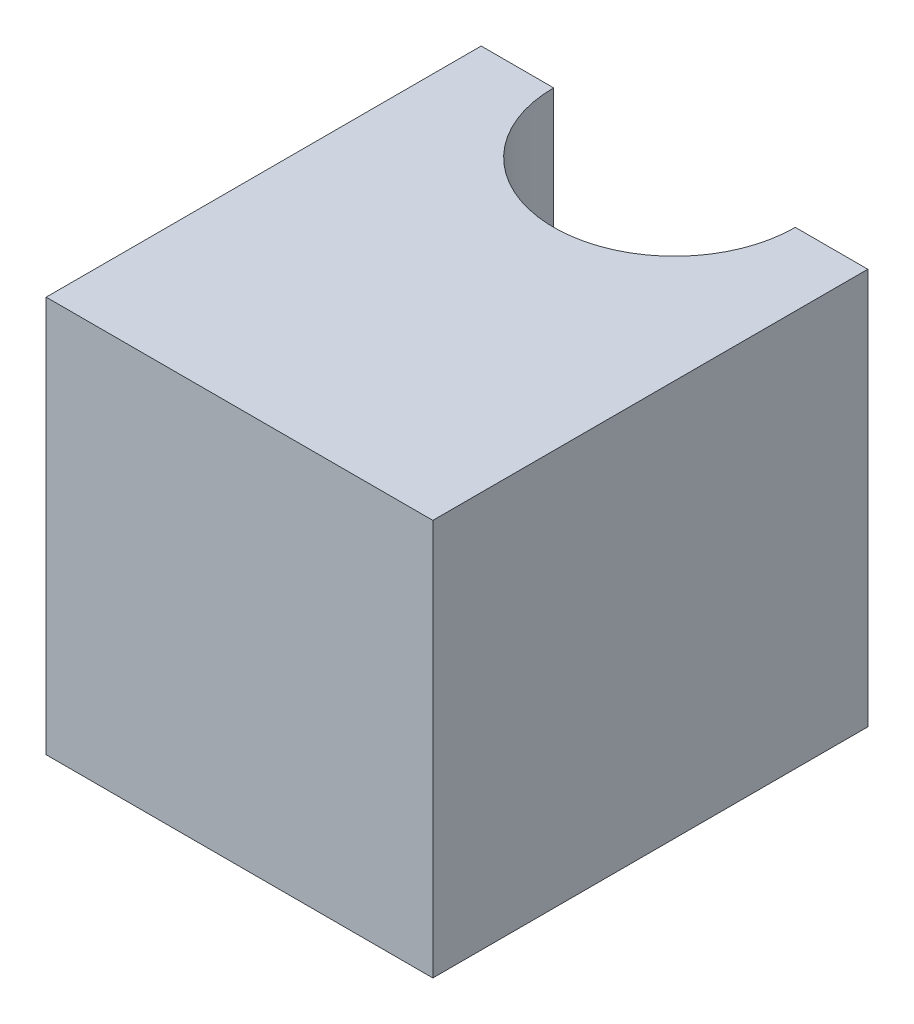
ISO-10303-21;
HEADER;
FILE_DESCRIPTION(('STEP AP214'),'2;1');
FILE_NAME('part.step','',(''),(''),'','','');
FILE_SCHEMA(('AUTOMOTIVE_DESIGN { 1 0 10303 214 1 1 1 1 }'));
ENDSEC;
DATA;
#1=APPLICATION_CONTEXT('core data for automotive mechanical design processes');
#2=APPLICATION_PROTOCOL_DEFINITION('international standard','automotive_design',2000,#1);
#3=PRODUCT_CONTEXT('',#1,'mechanical');
#4=PRODUCT('Part','Part','',(#3));
#5=PRODUCT_RELATED_PRODUCT_CATEGORY('part','',(#4));
#6=PRODUCT_DEFINITION_FORMATION('','',#4);
#7=PRODUCT_DEFINITION_CONTEXT('part definition',#1,'design');
#8=PRODUCT_DEFINITION('design','',#6,#7);
#9=PRODUCT_DEFINITION_SHAPE('','',#8);
#10=(LENGTH_UNIT() NAMED_UNIT(*) SI_UNIT(.MILLI.,.METRE.));
#11=(NAMED_UNIT(*) PLANE_ANGLE_UNIT() SI_UNIT($,.RADIAN.));
#12=(NAMED_UNIT(*) SI_UNIT($,.STERADIAN.) SOLID_ANGLE_UNIT());
#13=UNCERTAINTY_MEASURE_WITH_UNIT(LENGTH_MEASURE(1.E-05),#10,'distance_accuracy_value','');
#14=(GEOMETRIC_REPRESENTATION_CONTEXT(3) GLOBAL_UNCERTAINTY_ASSIGNED_CONTEXT((#13)) GLOBAL_UNIT_ASSIGNED_CONTEXT((#10,
#11,#12)) REPRESENTATION_CONTEXT('',''));
#15=CARTESIAN_POINT('',(0.,0.,0.));
#16=DIRECTION('',(0.,0.,1.));
#17=DIRECTION('',(1.,0.,0.));
#18=AXIS2_PLACEMENT_3D('',#15,#16,#17);
#19=CARTESIAN_POINT('',(3.,0.,-5.2));
#20=DIRECTION('',(1.,0.,0.));
#21=DIRECTION('',(0.,0.,-1.));
#22=AXIS2_PLACEMENT_3D('',#19,#20,#21);
#23=PLANE('',#22);
#24=DIRECTION('',(0.,0.,1.));
#25=VECTOR('',#24,1.);
#26=CARTESIAN_POINT('',(3.,0.82,-5.65));
#27=LINE('',#26,#25);
#28=CARTESIAN_POINT('',(3.,0.82,-5.2));
#29=VERTEX_POINT('',#28);
#30=CARTESIAN_POINT('',(3.,0.82,-6.1));
#31=VERTEX_POINT('',#30);
#32=EDGE_CURVE('E108',#29,#31,#27,.F.);
#33=ORIENTED_EDGE('',*,*,#32,.F.);
#34=DIRECTION('',(0.,1.,0.));
#35=VECTOR('',#34,1.);
#36=CARTESIAN_POINT('',(3.,0.,-5.2));
#37=LINE('',#36,#35);
#38=CARTESIAN_POINT('',(3.,0.,-5.2));
#39=VERTEX_POINT('',#38);
#40=EDGE_CURVE('E92',#39,#29,#37,.T.);
#41=ORIENTED_EDGE('',*,*,#40,.F.);
#42=DIRECTION('',(0.,0.,1.));
#43=VECTOR('',#42,1.);
#44=CARTESIAN_POINT('',(3.,0.,-5.65));
#45=LINE('',#44,#43);
#46=CARTESIAN_POINT('',(3.,0.,-6.1));
#47=VERTEX_POINT('',#46);
#48=EDGE_CURVE('E76',#39,#47,#45,.F.);
#49=ORIENTED_EDGE('',*,*,#48,.T.);
#50=DIRECTION('',(0.,1.,0.));
#51=VECTOR('',#50,1.);
#52=CARTESIAN_POINT('',(3.,0.,-6.1));
#53=LINE('',#52,#51);
#54=EDGE_CURVE('E73',#31,#47,#53,.F.);
#55=ORIENTED_EDGE('',*,*,#54,.F.);
#56=EDGE_LOOP('',(#33,#41,#49,#55));
#57=FACE_BOUND('',#56,.T.);
#58=ADVANCED_FACE('F17',(#57),#23,.T.);
#59=CARTESIAN_POINT('',(3.,0.,-6.1));
#60=DIRECTION('',(0.,0.,-1.));
#61=DIRECTION('',(-1.,0.,0.));
#62=AXIS2_PLACEMENT_3D('',#59,#60,#61);
#63=PLANE('',#62);
#64=DIRECTION('',(1.,0.,0.));
#65=VECTOR('',#64,1.);
#66=CARTESIAN_POINT('',(2.6,0.82,-6.1));
#67=LINE('',#66,#65);
#68=CARTESIAN_POINT('',(2.85,0.82,-6.1));
#69=VERTEX_POINT('',#68);
#70=EDGE_CURVE('E106',#31,#69,#67,.F.);
#71=ORIENTED_EDGE('',*,*,#70,.F.);
#72=ORIENTED_EDGE('',*,*,#54,.T.);
#73=DIRECTION('',(1.,0.,0.));
#74=VECTOR('',#73,1.);
#75=CARTESIAN_POINT('',(2.6,0.,-6.1));
#76=LINE('',#75,#74);
#77=CARTESIAN_POINT('',(2.85,0.,-6.1));
#78=VERTEX_POINT('',#77);
#79=EDGE_CURVE('E67',#47,#78,#76,.F.);
#80=ORIENTED_EDGE('',*,*,#79,.T.);
#81=DIRECTION('',(0.,1.,0.));
#82=VECTOR('',#81,1.);
#83=CARTESIAN_POINT('',(2.85,0.,-6.1));
#84=LINE('',#83,#82);
#85=EDGE_CURVE('E71',#78,#69,#84,.T.);
#86=ORIENTED_EDGE('',*,*,#85,.T.);
#87=EDGE_LOOP('',(#71,#72,#80,#86));
#88=FACE_BOUND('',#87,.T.);
#89=ADVANCED_FACE('F70',(#88),#63,.T.);
#90=CARTESIAN_POINT('',(2.6,0.,-6.1));
#91=DIRECTION('',(0.,1.,0.));
#92=DIRECTION('',(0.,0.,1.));
#93=AXIS2_PLACEMENT_3D('',#90,#91,#92);
#94=CYLINDRICAL_SURFACE('',#93,0.25);
#95=DIRECTION('',(0.,1.,0.));
#96=VECTOR('',#95,1.);
#97=CARTESIAN_POINT('',(2.35,0.,-6.1));
#98=LINE('',#97,#96);
#99=CARTESIAN_POINT('',(2.35,0.82,-6.1));
#100=VERTEX_POINT('',#99);
#101=CARTESIAN_POINT('',(2.35,0.,-6.1));
#102=VERTEX_POINT('',#101);
#103=EDGE_CURVE('E117',#100,#102,#98,.F.);
#104=ORIENTED_EDGE('',*,*,#103,.F.);
#105=CARTESIAN_POINT('',(2.6,0.82,-6.1));
#106=DIRECTION('',(0.,1.,0.));
#107=DIRECTION('',(0.,0.,1.));
#108=AXIS2_PLACEMENT_3D('',#105,#106,#107);
#109=CIRCLE('',#108,0.25);
#110=EDGE_CURVE('E83',#69,#100,#109,.F.);
#111=ORIENTED_EDGE('',*,*,#110,.F.);
#112=ORIENTED_EDGE('',*,*,#85,.F.);
#113=CARTESIAN_POINT('',(2.6,0.,-6.1));
#114=DIRECTION('',(0.,1.,0.));
#115=DIRECTION('',(0.,0.,1.));
#116=AXIS2_PLACEMENT_3D('',#113,#114,#115);
#117=CIRCLE('',#116,0.25);
#118=EDGE_CURVE('E20',#78,#102,#117,.F.);
#119=ORIENTED_EDGE('',*,*,#118,.T.);
#120=EDGE_LOOP('',(#104,#111,#112,#119));
#121=FACE_BOUND('',#120,.T.);
#122=ADVANCED_FACE('F81',(#121),#94,.F.);
#123=CARTESIAN_POINT('',(2.6,0.,-5.65));
#124=DIRECTION('',(0.,1.,0.));
#125=DIRECTION('',(0.,0.,1.));
#126=AXIS2_PLACEMENT_3D('',#123,#124,#125);
#127=PLANE('',#126);
#128=DIRECTION('',(0.,0.,1.));
#129=VECTOR('',#128,1.);
#130=CARTESIAN_POINT('',(2.2,0.,-6.1));
#131=LINE('',#130,#129);
#132=CARTESIAN_POINT('',(2.2,0.,-6.1));
#133=VERTEX_POINT('',#132);
#134=CARTESIAN_POINT('',(2.2,0.,-5.2));
#135=VERTEX_POINT('',#134);
#136=EDGE_CURVE('E119',#133,#135,#131,.T.);
#137=ORIENTED_EDGE('',*,*,#136,.F.);
#138=DIRECTION('',(-1.,0.,0.));
#139=VECTOR('',#138,1.);
#140=CARTESIAN_POINT('',(2.35,0.,-6.1));
#141=LINE('',#140,#139);
#142=EDGE_CURVE('E88',#102,#133,#141,.T.);
#143=ORIENTED_EDGE('',*,*,#142,.F.);
#144=ORIENTED_EDGE('',*,*,#118,.F.);
#145=ORIENTED_EDGE('',*,*,#79,.F.);
#146=ORIENTED_EDGE('',*,*,#48,.F.);
#147=DIRECTION('',(1.,0.,0.));
#148=VECTOR('',#147,1.);
#149=CARTESIAN_POINT('',(2.2,0.,-5.2));
#150=LINE('',#149,#148);
#151=EDGE_CURVE('E90',#135,#39,#150,.T.);
#152=ORIENTED_EDGE('',*,*,#151,.F.);
#153=EDGE_LOOP('',(#137,#143,#144,#145,#146,#152));
#154=FACE_BOUND('',#153,.T.);
#155=ADVANCED_FACE('F86',(#154),#127,.F.);
#156=CARTESIAN_POINT('',(2.2,0.,-5.2));
#157=DIRECTION('',(0.,0.,1.));
#158=DIRECTION('',(1.,0.,0.));
#159=AXIS2_PLACEMENT_3D('',#156,#157,#158);
#160=PLANE('',#159);
#161=DIRECTION('',(1.,0.,0.));
#162=VECTOR('',#161,1.);
#163=CARTESIAN_POINT('',(2.6,0.82,-5.2));
#164=LINE('',#163,#162);
#165=CARTESIAN_POINT('',(2.2,0.82,-5.2));
#166=VERTEX_POINT('',#165);
#167=EDGE_CURVE('E96',#166,#29,#164,.T.);
#168=ORIENTED_EDGE('',*,*,#167,.F.);
#169=DIRECTION('',(0.,1.,0.));
#170=VECTOR('',#169,1.);
#171=CARTESIAN_POINT('',(2.2,0.,-5.2));
#172=LINE('',#171,#170);
#173=EDGE_CURVE('E127',#135,#166,#172,.T.);
#174=ORIENTED_EDGE('',*,*,#173,.F.);
#175=ORIENTED_EDGE('',*,*,#151,.T.);
#176=ORIENTED_EDGE('',*,*,#40,.T.);
#177=EDGE_LOOP('',(#168,#174,#175,#176));
#178=FACE_BOUND('',#177,.T.);
#179=ADVANCED_FACE('F149',(#178),#160,.T.);
#180=CARTESIAN_POINT('',(2.6,0.82,-5.65));
#181=DIRECTION('',(0.,1.,0.));
#182=DIRECTION('',(0.,0.,1.));
#183=AXIS2_PLACEMENT_3D('',#180,#181,#182);
#184=PLANE('',#183);
#185=DIRECTION('',(-1.,0.,0.));
#186=VECTOR('',#185,1.);
#187=CARTESIAN_POINT('',(2.35,0.82,-6.1));
#188=LINE('',#187,#186);
#189=CARTESIAN_POINT('',(2.2,0.82,-6.1));
#190=VERTEX_POINT('',#189);
#191=EDGE_CURVE('E35',#190,#100,#188,.F.);
#192=ORIENTED_EDGE('',*,*,#191,.F.);
#193=DIRECTION('',(0.,0.,1.));
#194=VECTOR('',#193,1.);
#195=CARTESIAN_POINT('',(2.2,0.82,-6.1));
#196=LINE('',#195,#194);
#197=EDGE_CURVE('E26',#166,#190,#196,.F.);
#198=ORIENTED_EDGE('',*,*,#197,.F.);
#199=ORIENTED_EDGE('',*,*,#167,.T.);
#200=ORIENTED_EDGE('',*,*,#32,.T.);
#201=ORIENTED_EDGE('',*,*,#70,.T.);
#202=ORIENTED_EDGE('',*,*,#110,.T.);
#203=EDGE_LOOP('',(#192,#198,#199,#200,#201,#202));
#204=FACE_BOUND('',#203,.T.);
#205=ADVANCED_FACE('F152',(#204),#184,.T.);
#206=CARTESIAN_POINT('',(2.35,0.,-6.1));
#207=DIRECTION('',(0.,0.,-1.));
#208=DIRECTION('',(-1.,0.,0.));
#209=AXIS2_PLACEMENT_3D('',#206,#207,#208);
#210=PLANE('',#209);
#211=ORIENTED_EDGE('',*,*,#191,.T.);
#212=ORIENTED_EDGE('',*,*,#103,.T.);
#213=ORIENTED_EDGE('',*,*,#142,.T.);
#214=DIRECTION('',(0.,1.,0.));
#215=VECTOR('',#214,1.);
#216=CARTESIAN_POINT('',(2.2,0.,-6.1));
#217=LINE('',#216,#215);
#218=EDGE_CURVE('E11',#190,#133,#217,.F.);
#219=ORIENTED_EDGE('',*,*,#218,.F.);
#220=EDGE_LOOP('',(#211,#212,#213,#219));
#221=FACE_BOUND('',#220,.T.);
#222=ADVANCED_FACE('F154',(#221),#210,.T.);
#223=CARTESIAN_POINT('',(2.2,0.,-6.1));
#224=DIRECTION('',(-1.,0.,0.));
#225=DIRECTION('',(0.,0.,1.));
#226=AXIS2_PLACEMENT_3D('',#223,#224,#225);
#227=PLANE('',#226);
#228=ORIENTED_EDGE('',*,*,#197,.T.);
#229=ORIENTED_EDGE('',*,*,#218,.T.);
#230=ORIENTED_EDGE('',*,*,#136,.T.);
#231=ORIENTED_EDGE('',*,*,#173,.T.);
#232=EDGE_LOOP('',(#228,#229,#230,#231));
#233=FACE_BOUND('',#232,.T.);
#234=ADVANCED_FACE('F148',(#233),#227,.T.);
#235=CLOSED_SHELL('',(#58,#89,#122,#155,#179,#205,#222,#234));
#236=MANIFOLD_SOLID_BREP('B1',#235);
#237=ADVANCED_BREP_SHAPE_REPRESENTATION('',(#18,#236),#14);
#238=SHAPE_DEFINITION_REPRESENTATION(#9,#237);
ENDSEC;
END-ISO-10303-21;
